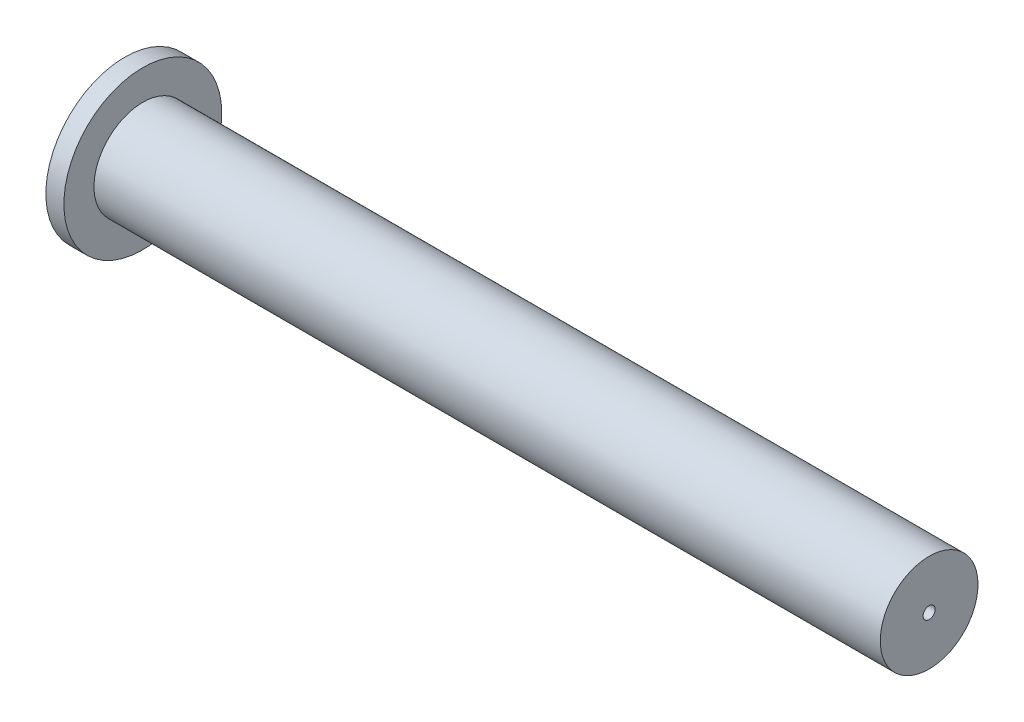
ISO-10303-21;
HEADER;
FILE_DESCRIPTION(('STEP AP214'),'2;1');
FILE_NAME('part.step','',(''),(''),'','','');
FILE_SCHEMA(('AUTOMOTIVE_DESIGN { 1 0 10303 214 1 1 1 1 }'));
ENDSEC;
DATA;
#1=APPLICATION_CONTEXT('core data for automotive mechanical design processes');
#2=APPLICATION_PROTOCOL_DEFINITION('international standard','automotive_design',2000,#1);
#3=PRODUCT_CONTEXT('',#1,'mechanical');
#4=PRODUCT('Part','Part','',(#3));
#5=PRODUCT_RELATED_PRODUCT_CATEGORY('part','',(#4));
#6=PRODUCT_DEFINITION_FORMATION('','',#4);
#7=PRODUCT_DEFINITION_CONTEXT('part definition',#1,'design');
#8=PRODUCT_DEFINITION('design','',#6,#7);
#9=PRODUCT_DEFINITION_SHAPE('','',#8);
#10=(LENGTH_UNIT() NAMED_UNIT(*) SI_UNIT(.MILLI.,.METRE.));
#11=(NAMED_UNIT(*) PLANE_ANGLE_UNIT() SI_UNIT($,.RADIAN.));
#12=(NAMED_UNIT(*) SI_UNIT($,.STERADIAN.) SOLID_ANGLE_UNIT());
#13=UNCERTAINTY_MEASURE_WITH_UNIT(LENGTH_MEASURE(1.E-05),#10,'distance_accuracy_value','');
#14=(GEOMETRIC_REPRESENTATION_CONTEXT(3) GLOBAL_UNCERTAINTY_ASSIGNED_CONTEXT((#13)) GLOBAL_UNIT_ASSIGNED_CONTEXT((#10,
#11,#12)) REPRESENTATION_CONTEXT('',''));
#15=CARTESIAN_POINT('',(0.,0.,0.));
#16=DIRECTION('',(0.,0.,1.));
#17=DIRECTION('',(1.,0.,0.));
#18=AXIS2_PLACEMENT_3D('',#15,#16,#17);
#19=CARTESIAN_POINT('',(-41.3,5.24999999999999,0.));
#20=DIRECTION('',(1.,0.,0.));
#21=DIRECTION('',(0.,0.,-1.));
#22=AXIS2_PLACEMENT_3D('',#19,#20,#21);
#23=PLANE('',#22);
#24=CARTESIAN_POINT('',(-41.3,0.,0.));
#25=DIRECTION('',(1.,0.,0.));
#26=DIRECTION('',(0.,0.,-1.));
#27=AXIS2_PLACEMENT_3D('',#24,#25,#26);
#28=CIRCLE('',#27,5.24999999999999);
#29=CARTESIAN_POINT('',(-41.3,0.,-5.24999999999999));
#30=VERTEX_POINT('',#29);
#31=EDGE_CURVE('E59',#30,#30,#28,.T.);
#32=ORIENTED_EDGE('',*,*,#31,.T.);
#33=EDGE_LOOP('',(#32));
#34=FACE_BOUND('',#33,.T.);
#35=CARTESIAN_POINT('',(-41.3,0.,0.));
#36=DIRECTION('',(1.,0.,0.));
#37=DIRECTION('',(0.,0.,-1.));
#38=AXIS2_PLACEMENT_3D('',#35,#36,#37);
#39=CIRCLE('',#38,3.24999999999999);
#40=CARTESIAN_POINT('',(-41.3,0.,-3.24999999999999));
#41=VERTEX_POINT('',#40);
#42=EDGE_CURVE('E10',#41,#41,#39,.T.);
#43=ORIENTED_EDGE('',*,*,#42,.F.);
#44=EDGE_LOOP('',(#43));
#45=FACE_BOUND('',#44,.T.);
#46=ADVANCED_FACE('F31',(#34,#45),#23,.T.);
#47=CARTESIAN_POINT('',(13.5,0.,0.));
#48=DIRECTION('',(1.,0.,0.));
#49=DIRECTION('',(0.,0.,-1.));
#50=AXIS2_PLACEMENT_3D('',#47,#48,#49);
#51=CYLINDRICAL_SURFACE('',#50,3.25);
#52=ORIENTED_EDGE('',*,*,#42,.T.);
#53=EDGE_LOOP('',(#52));
#54=FACE_BOUND('',#53,.T.);
#55=CARTESIAN_POINT('',(11.,0.,0.));
#56=DIRECTION('',(1.,0.,0.));
#57=DIRECTION('',(0.,0.,-1.));
#58=AXIS2_PLACEMENT_3D('',#55,#56,#57);
#59=CIRCLE('',#58,3.25);
#60=CARTESIAN_POINT('',(11.,0.,-3.25));
#61=VERTEX_POINT('',#60);
#62=EDGE_CURVE('E37',#61,#61,#59,.T.);
#63=ORIENTED_EDGE('',*,*,#62,.F.);
#64=EDGE_LOOP('',(#63));
#65=FACE_BOUND('',#64,.T.);
#66=ADVANCED_FACE('F77',(#54,#65),#51,.T.);
#67=CARTESIAN_POINT('',(11.,0.399999999999997,0.));
#68=DIRECTION('',(1.,0.,0.));
#69=DIRECTION('',(0.,0.,-1.));
#70=AXIS2_PLACEMENT_3D('',#67,#68,#69);
#71=PLANE('',#70);
#72=ORIENTED_EDGE('',*,*,#62,.T.);
#73=EDGE_LOOP('',(#72));
#74=FACE_BOUND('',#73,.T.);
#75=CARTESIAN_POINT('',(11.,0.,0.));
#76=DIRECTION('',(1.,0.,0.));
#77=DIRECTION('',(0.,0.,-1.));
#78=AXIS2_PLACEMENT_3D('',#75,#76,#77);
#79=CIRCLE('',#78,0.399999999999997);
#80=CARTESIAN_POINT('',(11.,0.,-0.399999999999997));
#81=VERTEX_POINT('',#80);
#82=EDGE_CURVE('E41',#81,#81,#79,.T.);
#83=ORIENTED_EDGE('',*,*,#82,.F.);
#84=EDGE_LOOP('',(#83));
#85=FACE_BOUND('',#84,.T.);
#86=ADVANCED_FACE('F81',(#74,#85),#71,.T.);
#87=CARTESIAN_POINT('',(13.5,0.,0.));
#88=DIRECTION('',(1.,0.,0.));
#89=DIRECTION('',(0.,0.,-1.));
#90=AXIS2_PLACEMENT_3D('',#87,#88,#89);
#91=CYLINDRICAL_SURFACE('',#90,0.399999999999997);
#92=ORIENTED_EDGE('',*,*,#82,.T.);
#93=EDGE_LOOP('',(#92));
#94=FACE_BOUND('',#93,.T.);
#95=CARTESIAN_POINT('',(10.,0.,0.));
#96=DIRECTION('',(1.,0.,0.));
#97=DIRECTION('',(0.,0.,-1.));
#98=AXIS2_PLACEMENT_3D('',#95,#96,#97);
#99=CIRCLE('',#98,0.399999999999997);
#100=CARTESIAN_POINT('',(10.,0.,-0.399999999999997));
#101=VERTEX_POINT('',#100);
#102=EDGE_CURVE('E45',#101,#101,#99,.T.);
#103=ORIENTED_EDGE('',*,*,#102,.F.);
#104=EDGE_LOOP('',(#103));
#105=FACE_BOUND('',#104,.T.);
#106=ADVANCED_FACE('F85',(#94,#105),#91,.F.);
#107=CARTESIAN_POINT('',(10.,0.399999999999997,0.));
#108=DIRECTION('',(-1.,0.,0.));
#109=DIRECTION('',(0.,0.,1.));
#110=AXIS2_PLACEMENT_3D('',#107,#108,#109);
#111=PLANE('',#110);
#112=ORIENTED_EDGE('',*,*,#102,.T.);
#113=EDGE_LOOP('',(#112));
#114=FACE_BOUND('',#113,.T.);
#115=CARTESIAN_POINT('',(10.,0.,0.));
#116=DIRECTION('',(1.,0.,0.));
#117=DIRECTION('',(0.,0.,-1.));
#118=AXIS2_PLACEMENT_3D('',#115,#116,#117);
#119=CIRCLE('',#118,2.25);
#120=CARTESIAN_POINT('',(10.,0.,-2.25));
#121=VERTEX_POINT('',#120);
#122=EDGE_CURVE('E50',#121,#121,#119,.T.);
#123=ORIENTED_EDGE('',*,*,#122,.F.);
#124=EDGE_LOOP('',(#123));
#125=FACE_BOUND('',#124,.T.);
#126=ADVANCED_FACE('F91',(#114,#125),#111,.T.);
#127=CARTESIAN_POINT('',(13.5,0.,0.));
#128=DIRECTION('',(1.,0.,0.));
#129=DIRECTION('',(0.,0.,-1.));
#130=AXIS2_PLACEMENT_3D('',#127,#128,#129);
#131=CYLINDRICAL_SURFACE('',#130,2.25);
#132=ORIENTED_EDGE('',*,*,#122,.T.);
#133=EDGE_LOOP('',(#132));
#134=FACE_BOUND('',#133,.T.);
#135=CARTESIAN_POINT('',(-42.5,0.,0.));
#136=DIRECTION('',(1.,0.,0.));
#137=DIRECTION('',(0.,0.,-1.));
#138=AXIS2_PLACEMENT_3D('',#135,#136,#137);
#139=CIRCLE('',#138,2.24999999999999);
#140=CARTESIAN_POINT('',(-42.5,0.,-2.24999999999999));
#141=VERTEX_POINT('',#140);
#142=EDGE_CURVE('E53',#141,#141,#139,.T.);
#143=ORIENTED_EDGE('',*,*,#142,.F.);
#144=EDGE_LOOP('',(#143));
#145=FACE_BOUND('',#144,.T.);
#146=ADVANCED_FACE('F73',(#134,#145),#131,.F.);
#147=CARTESIAN_POINT('',(-42.5,2.24999999999999,0.));
#148=DIRECTION('',(-1.,0.,0.));
#149=DIRECTION('',(0.,0.,1.));
#150=AXIS2_PLACEMENT_3D('',#147,#148,#149);
#151=PLANE('',#150);
#152=ORIENTED_EDGE('',*,*,#142,.T.);
#153=EDGE_LOOP('',(#152));
#154=FACE_BOUND('',#153,.T.);
#155=CARTESIAN_POINT('',(-42.5,0.,0.));
#156=DIRECTION('',(1.,0.,0.));
#157=DIRECTION('',(0.,0.,-1.));
#158=AXIS2_PLACEMENT_3D('',#155,#156,#157);
#159=CIRCLE('',#158,5.24999999999999);
#160=CARTESIAN_POINT('',(-42.5,0.,-5.24999999999999));
#161=VERTEX_POINT('',#160);
#162=EDGE_CURVE('E56',#161,#161,#159,.T.);
#163=ORIENTED_EDGE('',*,*,#162,.F.);
#164=EDGE_LOOP('',(#163));
#165=FACE_BOUND('',#164,.T.);
#166=ADVANCED_FACE('F67',(#154,#165),#151,.T.);
#167=CARTESIAN_POINT('',(13.5,0.,0.));
#168=DIRECTION('',(1.,0.,0.));
#169=DIRECTION('',(0.,0.,-1.));
#170=AXIS2_PLACEMENT_3D('',#167,#168,#169);
#171=CYLINDRICAL_SURFACE('',#170,5.24999999999999);
#172=ORIENTED_EDGE('',*,*,#162,.T.);
#173=EDGE_LOOP('',(#172));
#174=FACE_BOUND('',#173,.T.);
#175=ORIENTED_EDGE('',*,*,#31,.F.);
#176=EDGE_LOOP('',(#175));
#177=FACE_BOUND('',#176,.T.);
#178=ADVANCED_FACE('F65',(#174,#177),#171,.T.);
#179=CLOSED_SHELL('',(#46,#66,#86,#106,#126,#146,#166,#178));
#180=MANIFOLD_SOLID_BREP('B2',#179);
#181=ADVANCED_BREP_SHAPE_REPRESENTATION('',(#18,#180),#14);
#182=SHAPE_DEFINITION_REPRESENTATION(#9,#181);
ENDSEC;
END-ISO-10303-21;
